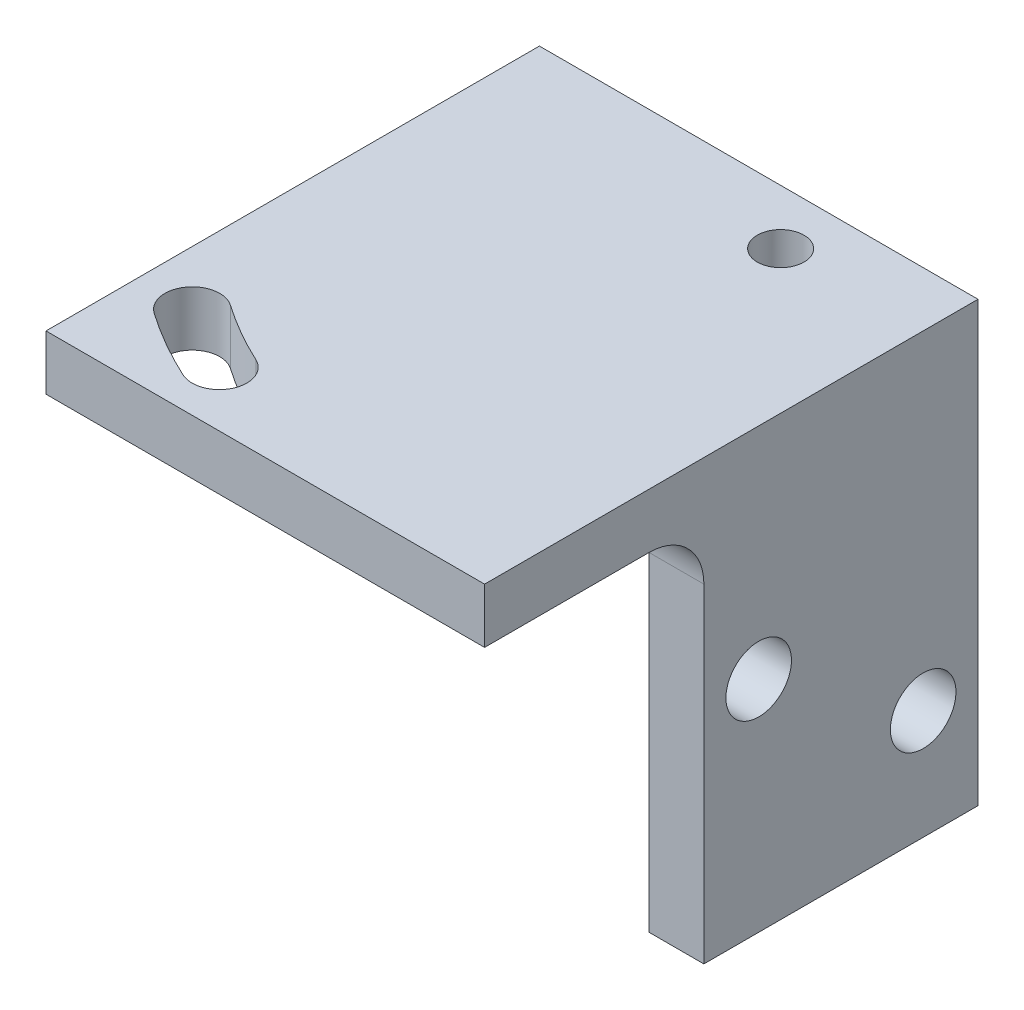
ISO-10303-21;
HEADER;
FILE_DESCRIPTION(('STEP AP214'),'2;1');
FILE_NAME('part.step','',(''),(''),'','','');
FILE_SCHEMA(('AUTOMOTIVE_DESIGN { 1 0 10303 214 1 1 1 1 }'));
ENDSEC;
DATA;
#1=APPLICATION_CONTEXT('core data for automotive mechanical design processes');
#2=APPLICATION_PROTOCOL_DEFINITION('international standard','automotive_design',2000,#1);
#3=PRODUCT_CONTEXT('',#1,'mechanical');
#4=PRODUCT('Part','Part','',(#3));
#5=PRODUCT_RELATED_PRODUCT_CATEGORY('part','',(#4));
#6=PRODUCT_DEFINITION_FORMATION('','',#4);
#7=PRODUCT_DEFINITION_CONTEXT('part definition',#1,'design');
#8=PRODUCT_DEFINITION('design','',#6,#7);
#9=PRODUCT_DEFINITION_SHAPE('','',#8);
#10=(LENGTH_UNIT() NAMED_UNIT(*) SI_UNIT(.MILLI.,.METRE.));
#11=(NAMED_UNIT(*) PLANE_ANGLE_UNIT() SI_UNIT($,.RADIAN.));
#12=(NAMED_UNIT(*) SI_UNIT($,.STERADIAN.) SOLID_ANGLE_UNIT());
#13=UNCERTAINTY_MEASURE_WITH_UNIT(LENGTH_MEASURE(1.E-05),#10,'distance_accuracy_value','');
#14=(GEOMETRIC_REPRESENTATION_CONTEXT(3) GLOBAL_UNCERTAINTY_ASSIGNED_CONTEXT((#13)) GLOBAL_UNIT_ASSIGNED_CONTEXT((#10,
#11,#12)) REPRESENTATION_CONTEXT('',''));
#15=CARTESIAN_POINT('',(0.,0.,0.));
#16=DIRECTION('',(0.,0.,1.));
#17=DIRECTION('',(1.,0.,0.));
#18=AXIS2_PLACEMENT_3D('',#15,#16,#17);
#19=CARTESIAN_POINT('',(-3.175,0.,28.575));
#20=DIRECTION('',(-1.,0.,0.));
#21=DIRECTION('',(0.,-1.,0.));
#22=AXIS2_PLACEMENT_3D('',#19,#20,#21);
#23=PLANE('',#22);
#24=DIRECTION('',(0.,-1.,0.));
#25=VECTOR('',#24,1.);
#26=CARTESIAN_POINT('',(-3.175,-25.4,15.875));
#27=LINE('',#26,#25);
#28=CARTESIAN_POINT('',(-3.175,-6.35,15.875));
#29=VERTEX_POINT('',#28);
#30=CARTESIAN_POINT('',(-3.175,-25.4,15.875));
#31=VERTEX_POINT('',#30);
#32=EDGE_CURVE('E143',#29,#31,#27,.T.);
#33=ORIENTED_EDGE('',*,*,#32,.F.);
#34=DIRECTION('',(0.,0.,-1.));
#35=VECTOR('',#34,1.);
#36=CARTESIAN_POINT('',(-3.175,-6.35,28.575));
#37=LINE('',#36,#35);
#38=CARTESIAN_POINT('',(-3.175,-6.35,0.));
#39=VERTEX_POINT('',#38);
#40=EDGE_CURVE('E176',#29,#39,#37,.T.);
#41=ORIENTED_EDGE('',*,*,#40,.T.);
#42=DIRECTION('',(0.,1.,0.));
#43=VECTOR('',#42,1.);
#44=CARTESIAN_POINT('',(-3.175,0.,0.));
#45=LINE('',#44,#43);
#46=CARTESIAN_POINT('',(-3.175,-25.4,0.));
#47=VERTEX_POINT('',#46);
#48=EDGE_CURVE('E164',#47,#39,#45,.T.);
#49=ORIENTED_EDGE('',*,*,#48,.F.);
#50=DIRECTION('',(0.,0.,-1.));
#51=VECTOR('',#50,1.);
#52=CARTESIAN_POINT('',(-3.175,-25.4,28.575));
#53=LINE('',#52,#51);
#54=EDGE_CURVE('E152',#31,#47,#53,.T.);
#55=ORIENTED_EDGE('',*,*,#54,.F.);
#56=EDGE_LOOP('',(#33,#41,#49,#55));
#57=FACE_BOUND('',#56,.T.);
#58=CARTESIAN_POINT('',(-3.175,-12.7,12.7));
#59=DIRECTION('',(-1.,0.,0.));
#60=DIRECTION('',(0.,0.,1.));
#61=AXIS2_PLACEMENT_3D('',#58,#59,#60);
#62=CIRCLE('',#61,1.89864999999999);
#63=CARTESIAN_POINT('',(-3.175,-12.7,14.59865));
#64=VERTEX_POINT('',#63);
#65=EDGE_CURVE('E221',#64,#64,#62,.T.);
#66=ORIENTED_EDGE('',*,*,#65,.F.);
#67=EDGE_LOOP('',(#66));
#68=FACE_BOUND('',#67,.T.);
#69=CARTESIAN_POINT('',(-3.175,-19.05,3.175));
#70=DIRECTION('',(-1.,0.,0.));
#71=DIRECTION('',(0.,0.,1.));
#72=AXIS2_PLACEMENT_3D('',#69,#70,#71);
#73=CIRCLE('',#72,1.89864999999999);
#74=CARTESIAN_POINT('',(-3.175,-19.05,5.07364999999999));
#75=VERTEX_POINT('',#74);
#76=EDGE_CURVE('E233',#75,#75,#73,.T.);
#77=ORIENTED_EDGE('',*,*,#76,.F.);
#78=EDGE_LOOP('',(#77));
#79=FACE_BOUND('',#78,.T.);
#80=ADVANCED_FACE('F37',(#57,#68,#79),#23,.T.);
#81=CARTESIAN_POINT('',(0.,-25.4,28.575));
#82=DIRECTION('',(0.,-1.,0.));
#83=DIRECTION('',(1.,0.,0.));
#84=AXIS2_PLACEMENT_3D('',#81,#82,#83);
#85=PLANE('',#84);
#86=DIRECTION('',(-1.,0.,0.));
#87=VECTOR('',#86,1.);
#88=CARTESIAN_POINT('',(0.,-25.4,15.875));
#89=LINE('',#88,#87);
#90=CARTESIAN_POINT('',(0.,-25.4,15.875));
#91=VERTEX_POINT('',#90);
#92=EDGE_CURVE('E137',#91,#31,#89,.T.);
#93=ORIENTED_EDGE('',*,*,#92,.T.);
#94=ORIENTED_EDGE('',*,*,#54,.T.);
#95=DIRECTION('',(-1.,0.,0.));
#96=VECTOR('',#95,1.);
#97=CARTESIAN_POINT('',(0.,-25.4,0.));
#98=LINE('',#97,#96);
#99=CARTESIAN_POINT('',(0.,-25.4,0.));
#100=VERTEX_POINT('',#99);
#101=EDGE_CURVE('E150',#100,#47,#98,.T.);
#102=ORIENTED_EDGE('',*,*,#101,.F.);
#103=DIRECTION('',(0.,0.,-1.));
#104=VECTOR('',#103,1.);
#105=CARTESIAN_POINT('',(0.,-25.4,28.575));
#106=LINE('',#105,#104);
#107=EDGE_CURVE('E133',#91,#100,#106,.T.);
#108=ORIENTED_EDGE('',*,*,#107,.F.);
#109=EDGE_LOOP('',(#93,#94,#102,#108));
#110=FACE_BOUND('',#109,.T.);
#111=ADVANCED_FACE('F148',(#110),#85,.T.);
#112=CARTESIAN_POINT('',(0.,0.,28.575));
#113=DIRECTION('',(1.,0.,0.));
#114=DIRECTION('',(0.,1.,0.));
#115=AXIS2_PLACEMENT_3D('',#112,#113,#114);
#116=PLANE('',#115);
#117=DIRECTION('',(0.,0.,-1.));
#118=VECTOR('',#117,1.);
#119=CARTESIAN_POINT('',(0.,-3.175,28.575));
#120=LINE('',#119,#118);
#121=CARTESIAN_POINT('',(0.,-3.175,28.575));
#122=VERTEX_POINT('',#121);
#123=CARTESIAN_POINT('',(0.,-3.175,19.05));
#124=VERTEX_POINT('',#123);
#125=EDGE_CURVE('E138',#122,#124,#120,.T.);
#126=ORIENTED_EDGE('',*,*,#125,.T.);
#127=CARTESIAN_POINT('',(0.,-6.35,19.05));
#128=DIRECTION('',(1.,0.,0.));
#129=DIRECTION('',(0.,1.,0.));
#130=AXIS2_PLACEMENT_3D('',#127,#128,#129);
#131=CIRCLE('',#130,3.175);
#132=CARTESIAN_POINT('',(0.,-6.35,15.875));
#133=VERTEX_POINT('',#132);
#134=EDGE_CURVE('E11',#124,#133,#131,.F.);
#135=ORIENTED_EDGE('',*,*,#134,.T.);
#136=DIRECTION('',(0.,-1.,0.));
#137=VECTOR('',#136,1.);
#138=CARTESIAN_POINT('',(0.,-25.4,15.875));
#139=LINE('',#138,#137);
#140=EDGE_CURVE('E127',#133,#91,#139,.T.);
#141=ORIENTED_EDGE('',*,*,#140,.T.);
#142=ORIENTED_EDGE('',*,*,#107,.T.);
#143=DIRECTION('',(0.,-1.,0.));
#144=VECTOR('',#143,1.);
#145=CARTESIAN_POINT('',(0.,0.,0.));
#146=LINE('',#145,#144);
#147=CARTESIAN_POINT('',(0.,0.,0.));
#148=VERTEX_POINT('',#147);
#149=EDGE_CURVE('E251',#148,#100,#146,.T.);
#150=ORIENTED_EDGE('',*,*,#149,.F.);
#151=DIRECTION('',(0.,0.,-1.));
#152=VECTOR('',#151,1.);
#153=CARTESIAN_POINT('',(0.,0.,28.575));
#154=LINE('',#153,#152);
#155=CARTESIAN_POINT('',(0.,0.,28.575));
#156=VERTEX_POINT('',#155);
#157=EDGE_CURVE('E153',#156,#148,#154,.T.);
#158=ORIENTED_EDGE('',*,*,#157,.F.);
#159=DIRECTION('',(0.,-1.,0.));
#160=VECTOR('',#159,1.);
#161=CARTESIAN_POINT('',(0.,0.,28.575));
#162=LINE('',#161,#160);
#163=EDGE_CURVE('E198',#156,#122,#162,.T.);
#164=ORIENTED_EDGE('',*,*,#163,.T.);
#165=EDGE_LOOP('',(#126,#135,#141,#142,#150,#158,#164));
#166=FACE_BOUND('',#165,.T.);
#167=CARTESIAN_POINT('',(0.,-12.7,12.7));
#168=DIRECTION('',(-1.,0.,0.));
#169=DIRECTION('',(0.,0.,1.));
#170=AXIS2_PLACEMENT_3D('',#167,#168,#169);
#171=CIRCLE('',#170,1.89865);
#172=CARTESIAN_POINT('',(0.,-12.7,14.59865));
#173=VERTEX_POINT('',#172);
#174=EDGE_CURVE('E230',#173,#173,#171,.T.);
#175=ORIENTED_EDGE('',*,*,#174,.T.);
#176=EDGE_LOOP('',(#175));
#177=FACE_BOUND('',#176,.T.);
#178=CARTESIAN_POINT('',(0.,-19.05,3.175));
#179=DIRECTION('',(-1.,0.,0.));
#180=DIRECTION('',(0.,0.,1.));
#181=AXIS2_PLACEMENT_3D('',#178,#179,#180);
#182=CIRCLE('',#181,1.89865);
#183=CARTESIAN_POINT('',(0.,-19.05,5.07365));
#184=VERTEX_POINT('',#183);
#185=EDGE_CURVE('E236',#184,#184,#182,.T.);
#186=ORIENTED_EDGE('',*,*,#185,.T.);
#187=EDGE_LOOP('',(#186));
#188=FACE_BOUND('',#187,.T.);
#189=ADVANCED_FACE('F129',(#166,#177,#188),#116,.T.);
#190=CARTESIAN_POINT('',(0.,0.,28.575));
#191=DIRECTION('',(0.,-1.,0.));
#192=DIRECTION('',(1.,0.,0.));
#193=AXIS2_PLACEMENT_3D('',#190,#191,#192);
#194=PLANE('',#193);
#195=CARTESIAN_POINT('',(-8.255,0.,3.175));
#196=DIRECTION('',(0.,1.,0.));
#197=DIRECTION('',(-1.,0.,0.));
#198=AXIS2_PLACEMENT_3D('',#195,#196,#197);
#199=CIRCLE('',#198,22.8855463980274);
#200=CARTESIAN_POINT('',(-21.3454641445883,0.,21.9469999577965));
#201=VERTEX_POINT('',#200);
#202=CARTESIAN_POINT('',(-17.8868669962838,0.,23.9349463415049));
#203=VERTEX_POINT('',#202);
#204=EDGE_CURVE('E209',#201,#203,#199,.T.);
#205=ORIENTED_EDGE('',*,*,#204,.T.);
#206=CARTESIAN_POINT('',(-18.555,0.,25.375));
#207=DIRECTION('',(0.,1.,0.));
#208=DIRECTION('',(-1.,0.,0.));
#209=AXIS2_PLACEMENT_3D('',#206,#207,#208);
#210=CIRCLE('',#209,1.5875);
#211=CARTESIAN_POINT('',(-19.2231330037162,0.,26.8150536584951));
#212=VERTEX_POINT('',#211);
#213=EDGE_CURVE('E146',#212,#203,#210,.T.);
#214=ORIENTED_EDGE('',*,*,#213,.F.);
#215=CARTESIAN_POINT('',(-8.255,0.,3.175));
#216=DIRECTION('',(0.,1.,0.));
#217=DIRECTION('',(-1.,0.,0.));
#218=AXIS2_PLACEMENT_3D('',#215,#216,#217);
#219=CIRCLE('',#218,26.0605463980274);
#220=CARTESIAN_POINT('',(-23.1615546558749,0.,24.5513118160068));
#221=VERTEX_POINT('',#220);
#222=EDGE_CURVE('E215',#221,#212,#219,.T.);
#223=ORIENTED_EDGE('',*,*,#222,.F.);
#224=CARTESIAN_POINT('',(-22.2535094002316,0.,23.2491558869016));
#225=DIRECTION('',(0.,1.,0.));
#226=DIRECTION('',(-1.,0.,0.));
#227=AXIS2_PLACEMENT_3D('',#224,#225,#226);
#228=CIRCLE('',#227,1.5875);
#229=EDGE_CURVE('E212',#201,#221,#228,.T.);
#230=ORIENTED_EDGE('',*,*,#229,.F.);
#231=EDGE_LOOP('',(#205,#214,#223,#230));
#232=FACE_BOUND('',#231,.T.);
#233=CARTESIAN_POINT('',(-8.255,0.,3.175));
#234=DIRECTION('',(0.,1.,0.));
#235=DIRECTION('',(0.,0.,1.));
#236=AXIS2_PLACEMENT_3D('',#233,#234,#235);
#237=CIRCLE('',#236,1.35254999999999);
#238=CARTESIAN_POINT('',(-8.255,0.,4.52754999999999));
#239=VERTEX_POINT('',#238);
#240=EDGE_CURVE('E165',#239,#239,#237,.T.);
#241=ORIENTED_EDGE('',*,*,#240,.F.);
#242=EDGE_LOOP('',(#241));
#243=FACE_BOUND('',#242,.T.);
#244=DIRECTION('',(-1.,0.,0.));
#245=VECTOR('',#244,1.);
#246=CARTESIAN_POINT('',(0.,0.,0.));
#247=LINE('',#246,#245);
#248=CARTESIAN_POINT('',(-25.4,0.,0.));
#249=VERTEX_POINT('',#248);
#250=EDGE_CURVE('E253',#148,#249,#247,.T.);
#251=ORIENTED_EDGE('',*,*,#250,.T.);
#252=DIRECTION('',(0.,0.,-1.));
#253=VECTOR('',#252,1.);
#254=CARTESIAN_POINT('',(-25.4,0.,28.575));
#255=LINE('',#254,#253);
#256=CARTESIAN_POINT('',(-25.4,0.,28.575));
#257=VERTEX_POINT('',#256);
#258=EDGE_CURVE('E157',#257,#249,#255,.T.);
#259=ORIENTED_EDGE('',*,*,#258,.F.);
#260=DIRECTION('',(-1.,0.,0.));
#261=VECTOR('',#260,1.);
#262=CARTESIAN_POINT('',(0.,0.,28.575));
#263=LINE('',#262,#261);
#264=EDGE_CURVE('E243',#156,#257,#263,.T.);
#265=ORIENTED_EDGE('',*,*,#264,.F.);
#266=ORIENTED_EDGE('',*,*,#157,.T.);
#267=EDGE_LOOP('',(#251,#259,#265,#266));
#268=FACE_BOUND('',#267,.T.);
#269=ADVANCED_FACE('F265',(#232,#243,#268),#194,.F.);
#270=CARTESIAN_POINT('',(-25.4,0.,28.575));
#271=DIRECTION('',(1.,0.,0.));
#272=DIRECTION('',(0.,1.,0.));
#273=AXIS2_PLACEMENT_3D('',#270,#271,#272);
#274=PLANE('',#273);
#275=DIRECTION('',(0.,-1.,0.));
#276=VECTOR('',#275,1.);
#277=CARTESIAN_POINT('',(-25.4,0.,0.));
#278=LINE('',#277,#276);
#279=CARTESIAN_POINT('',(-25.4,-3.175,0.));
#280=VERTEX_POINT('',#279);
#281=EDGE_CURVE('E199',#249,#280,#278,.T.);
#282=ORIENTED_EDGE('',*,*,#281,.T.);
#283=DIRECTION('',(0.,0.,-1.));
#284=VECTOR('',#283,1.);
#285=CARTESIAN_POINT('',(-25.4,-3.175,28.575));
#286=LINE('',#285,#284);
#287=CARTESIAN_POINT('',(-25.4,-3.175,28.575));
#288=VERTEX_POINT('',#287);
#289=EDGE_CURVE('E197',#288,#280,#286,.T.);
#290=ORIENTED_EDGE('',*,*,#289,.F.);
#291=DIRECTION('',(0.,-1.,0.));
#292=VECTOR('',#291,1.);
#293=CARTESIAN_POINT('',(-25.4,0.,28.575));
#294=LINE('',#293,#292);
#295=EDGE_CURVE('E245',#257,#288,#294,.T.);
#296=ORIENTED_EDGE('',*,*,#295,.F.);
#297=ORIENTED_EDGE('',*,*,#258,.T.);
#298=EDGE_LOOP('',(#282,#290,#296,#297));
#299=FACE_BOUND('',#298,.T.);
#300=ADVANCED_FACE('F260',(#299),#274,.F.);
#301=CARTESIAN_POINT('',(0.,-3.175,28.575));
#302=DIRECTION('',(0.,1.,0.));
#303=DIRECTION('',(-1.,0.,0.));
#304=AXIS2_PLACEMENT_3D('',#301,#302,#303);
#305=PLANE('',#304);
#306=CARTESIAN_POINT('',(-8.255,-3.175,3.175));
#307=DIRECTION('',(0.,1.,0.));
#308=DIRECTION('',(-1.,0.,0.));
#309=AXIS2_PLACEMENT_3D('',#306,#307,#308);
#310=CIRCLE('',#309,26.0605463980274);
#311=CARTESIAN_POINT('',(-23.1615546558749,-3.175,24.5513118160068));
#312=VERTEX_POINT('',#311);
#313=CARTESIAN_POINT('',(-19.2231330037162,-3.175,26.8150536584951));
#314=VERTEX_POINT('',#313);
#315=EDGE_CURVE('E170',#312,#314,#310,.T.);
#316=ORIENTED_EDGE('',*,*,#315,.T.);
#317=CARTESIAN_POINT('',(-18.555,-3.175,25.375));
#318=DIRECTION('',(0.,1.,0.));
#319=DIRECTION('',(-1.,0.,0.));
#320=AXIS2_PLACEMENT_3D('',#317,#318,#319);
#321=CIRCLE('',#320,1.5875);
#322=CARTESIAN_POINT('',(-17.8868669962838,-3.175,23.9349463415049));
#323=VERTEX_POINT('',#322);
#324=EDGE_CURVE('E173',#314,#323,#321,.T.);
#325=ORIENTED_EDGE('',*,*,#324,.T.);
#326=CARTESIAN_POINT('',(-8.255,-3.175,3.175));
#327=DIRECTION('',(0.,1.,0.));
#328=DIRECTION('',(-1.,0.,0.));
#329=AXIS2_PLACEMENT_3D('',#326,#327,#328);
#330=CIRCLE('',#329,22.8855463980274);
#331=CARTESIAN_POINT('',(-21.3454641445883,-3.175,21.9469999577965));
#332=VERTEX_POINT('',#331);
#333=EDGE_CURVE('E155',#332,#323,#330,.T.);
#334=ORIENTED_EDGE('',*,*,#333,.F.);
#335=CARTESIAN_POINT('',(-22.2535094002316,-3.175,23.2491558869016));
#336=DIRECTION('',(0.,1.,0.));
#337=DIRECTION('',(-1.,0.,0.));
#338=AXIS2_PLACEMENT_3D('',#335,#336,#337);
#339=CIRCLE('',#338,1.5875);
#340=EDGE_CURVE('E167',#332,#312,#339,.T.);
#341=ORIENTED_EDGE('',*,*,#340,.T.);
#342=EDGE_LOOP('',(#316,#325,#334,#341));
#343=FACE_BOUND('',#342,.T.);
#344=CARTESIAN_POINT('',(-8.255,-3.175,3.175));
#345=DIRECTION('',(0.,1.,0.));
#346=DIRECTION('',(-1.,0.,0.));
#347=AXIS2_PLACEMENT_3D('',#344,#345,#346);
#348=CIRCLE('',#347,1.35254999999999);
#349=CARTESIAN_POINT('',(-9.60754999999999,-3.175,3.175));
#350=VERTEX_POINT('',#349);
#351=EDGE_CURVE('E161',#350,#350,#348,.T.);
#352=ORIENTED_EDGE('',*,*,#351,.T.);
#353=EDGE_LOOP('',(#352));
#354=FACE_BOUND('',#353,.T.);
#355=DIRECTION('',(1.,0.,0.));
#356=VECTOR('',#355,1.);
#357=CARTESIAN_POINT('',(0.,-3.175,0.));
#358=LINE('',#357,#356);
#359=CARTESIAN_POINT('',(-6.35,-3.175,0.));
#360=VERTEX_POINT('',#359);
#361=EDGE_CURVE('E189',#280,#360,#358,.T.);
#362=ORIENTED_EDGE('',*,*,#361,.T.);
#363=DIRECTION('',(0.,0.,-1.));
#364=VECTOR('',#363,1.);
#365=CARTESIAN_POINT('',(-6.35,-3.175,28.575));
#366=LINE('',#365,#364);
#367=CARTESIAN_POINT('',(-6.35,-3.175,19.05));
#368=VERTEX_POINT('',#367);
#369=EDGE_CURVE('E59',#360,#368,#366,.F.);
#370=ORIENTED_EDGE('',*,*,#369,.T.);
#371=DIRECTION('',(-1.,0.,0.));
#372=VECTOR('',#371,1.);
#373=CARTESIAN_POINT('',(0.,-3.175,19.05));
#374=LINE('',#373,#372);
#375=EDGE_CURVE('E179',#368,#124,#374,.F.);
#376=ORIENTED_EDGE('',*,*,#375,.T.);
#377=ORIENTED_EDGE('',*,*,#125,.F.);
#378=DIRECTION('',(1.,0.,0.));
#379=VECTOR('',#378,1.);
#380=CARTESIAN_POINT('',(0.,-3.175,28.575));
#381=LINE('',#380,#379);
#382=EDGE_CURVE('E247',#288,#122,#381,.T.);
#383=ORIENTED_EDGE('',*,*,#382,.F.);
#384=ORIENTED_EDGE('',*,*,#289,.T.);
#385=EDGE_LOOP('',(#362,#370,#376,#377,#383,#384));
#386=FACE_BOUND('',#385,.T.);
#387=ADVANCED_FACE('F194',(#343,#354,#386),#305,.F.);
#388=CARTESIAN_POINT('',(0.,0.,28.575));
#389=DIRECTION('',(0.,0.,1.));
#390=DIRECTION('',(1.,0.,0.));
#391=AXIS2_PLACEMENT_3D('',#388,#389,#390);
#392=PLANE('',#391);
#393=ORIENTED_EDGE('',*,*,#382,.T.);
#394=ORIENTED_EDGE('',*,*,#163,.F.);
#395=ORIENTED_EDGE('',*,*,#264,.T.);
#396=ORIENTED_EDGE('',*,*,#295,.T.);
#397=EDGE_LOOP('',(#393,#394,#395,#396));
#398=FACE_BOUND('',#397,.T.);
#399=ADVANCED_FACE('F267',(#398),#392,.T.);
#400=CARTESIAN_POINT('',(0.,0.,0.));
#401=DIRECTION('',(0.,0.,1.));
#402=DIRECTION('',(1.,0.,0.));
#403=AXIS2_PLACEMENT_3D('',#400,#401,#402);
#404=PLANE('',#403);
#405=ORIENTED_EDGE('',*,*,#48,.T.);
#406=CARTESIAN_POINT('',(-6.35,-6.35,0.));
#407=DIRECTION('',(0.,0.,1.));
#408=DIRECTION('',(1.,0.,0.));
#409=AXIS2_PLACEMENT_3D('',#406,#407,#408);
#410=CIRCLE('',#409,3.175);
#411=EDGE_CURVE('E46',#39,#360,#410,.T.);
#412=ORIENTED_EDGE('',*,*,#411,.T.);
#413=ORIENTED_EDGE('',*,*,#361,.F.);
#414=ORIENTED_EDGE('',*,*,#281,.F.);
#415=ORIENTED_EDGE('',*,*,#250,.F.);
#416=ORIENTED_EDGE('',*,*,#149,.T.);
#417=ORIENTED_EDGE('',*,*,#101,.T.);
#418=EDGE_LOOP('',(#405,#412,#413,#414,#415,#416,#417));
#419=FACE_BOUND('',#418,.T.);
#420=ADVANCED_FACE('F187',(#419),#404,.F.);
#421=CARTESIAN_POINT('',(-8.255,0.,3.175));
#422=DIRECTION('',(0.,1.,0.));
#423=DIRECTION('',(0.,0.,1.));
#424=AXIS2_PLACEMENT_3D('',#421,#422,#423);
#425=CYLINDRICAL_SURFACE('',#424,1.35254999999999);
#426=ORIENTED_EDGE('',*,*,#240,.T.);
#427=EDGE_LOOP('',(#426));
#428=FACE_BOUND('',#427,.T.);
#429=ORIENTED_EDGE('',*,*,#351,.F.);
#430=EDGE_LOOP('',(#429));
#431=FACE_BOUND('',#430,.T.);
#432=ADVANCED_FACE('F280',(#428,#431),#425,.F.);
#433=CARTESIAN_POINT('',(-3.175,-19.05,3.175));
#434=DIRECTION('',(-1.,0.,0.));
#435=DIRECTION('',(0.,0.,1.));
#436=AXIS2_PLACEMENT_3D('',#433,#434,#435);
#437=CYLINDRICAL_SURFACE('',#436,1.89864999999999);
#438=ORIENTED_EDGE('',*,*,#185,.F.);
#439=EDGE_LOOP('',(#438));
#440=FACE_BOUND('',#439,.T.);
#441=ORIENTED_EDGE('',*,*,#76,.T.);
#442=EDGE_LOOP('',(#441));
#443=FACE_BOUND('',#442,.T.);
#444=ADVANCED_FACE('F277',(#440,#443),#437,.F.);
#445=CARTESIAN_POINT('',(-3.175,-12.7,12.7));
#446=DIRECTION('',(-1.,0.,0.));
#447=DIRECTION('',(0.,0.,1.));
#448=AXIS2_PLACEMENT_3D('',#445,#446,#447);
#449=CYLINDRICAL_SURFACE('',#448,1.89864999999999);
#450=ORIENTED_EDGE('',*,*,#174,.F.);
#451=EDGE_LOOP('',(#450));
#452=FACE_BOUND('',#451,.T.);
#453=ORIENTED_EDGE('',*,*,#65,.T.);
#454=EDGE_LOOP('',(#453));
#455=FACE_BOUND('',#454,.T.);
#456=ADVANCED_FACE('F279',(#452,#455),#449,.F.);
#457=CARTESIAN_POINT('',(-18.555,-25.4,25.375));
#458=DIRECTION('',(0.,1.,0.));
#459=DIRECTION('',(-1.,0.,0.));
#460=AXIS2_PLACEMENT_3D('',#457,#458,#459);
#461=CYLINDRICAL_SURFACE('',#460,1.5875);
#462=DIRECTION('',(0.,1.,0.));
#463=VECTOR('',#462,1.);
#464=CARTESIAN_POINT('',(-19.2231330037162,-25.4,26.8150536584951));
#465=LINE('',#464,#463);
#466=EDGE_CURVE('E219',#314,#212,#465,.T.);
#467=ORIENTED_EDGE('',*,*,#466,.T.);
#468=ORIENTED_EDGE('',*,*,#213,.T.);
#469=DIRECTION('',(0.,1.,0.));
#470=VECTOR('',#469,1.);
#471=CARTESIAN_POINT('',(-17.8868669962838,-25.4,23.9349463415049));
#472=LINE('',#471,#470);
#473=EDGE_CURVE('E218',#323,#203,#472,.T.);
#474=ORIENTED_EDGE('',*,*,#473,.F.);
#475=ORIENTED_EDGE('',*,*,#324,.F.);
#476=EDGE_LOOP('',(#467,#468,#474,#475));
#477=FACE_BOUND('',#476,.T.);
#478=ADVANCED_FACE('F287',(#477),#461,.F.);
#479=CARTESIAN_POINT('',(-8.255,-25.4,3.175));
#480=DIRECTION('',(0.,1.,0.));
#481=DIRECTION('',(-1.,0.,0.));
#482=AXIS2_PLACEMENT_3D('',#479,#480,#481);
#483=CYLINDRICAL_SURFACE('',#482,26.0605463980274);
#484=DIRECTION('',(0.,1.,0.));
#485=VECTOR('',#484,1.);
#486=CARTESIAN_POINT('',(-23.1615546558749,-25.4,24.5513118160068));
#487=LINE('',#486,#485);
#488=EDGE_CURVE('E222',#312,#221,#487,.T.);
#489=ORIENTED_EDGE('',*,*,#488,.T.);
#490=ORIENTED_EDGE('',*,*,#222,.T.);
#491=ORIENTED_EDGE('',*,*,#466,.F.);
#492=ORIENTED_EDGE('',*,*,#315,.F.);
#493=EDGE_LOOP('',(#489,#490,#491,#492));
#494=FACE_BOUND('',#493,.T.);
#495=ADVANCED_FACE('F326',(#494),#483,.F.);
#496=CARTESIAN_POINT('',(-22.2535094002316,-25.4,23.2491558869016));
#497=DIRECTION('',(0.,1.,0.));
#498=DIRECTION('',(-1.,0.,0.));
#499=AXIS2_PLACEMENT_3D('',#496,#497,#498);
#500=CYLINDRICAL_SURFACE('',#499,1.5875);
#501=DIRECTION('',(0.,1.,0.));
#502=VECTOR('',#501,1.);
#503=CARTESIAN_POINT('',(-21.3454641445883,-25.4,21.9469999577965));
#504=LINE('',#503,#502);
#505=EDGE_CURVE('E224',#332,#201,#504,.T.);
#506=ORIENTED_EDGE('',*,*,#505,.T.);
#507=ORIENTED_EDGE('',*,*,#229,.T.);
#508=ORIENTED_EDGE('',*,*,#488,.F.);
#509=ORIENTED_EDGE('',*,*,#340,.F.);
#510=EDGE_LOOP('',(#506,#507,#508,#509));
#511=FACE_BOUND('',#510,.T.);
#512=ADVANCED_FACE('F322',(#511),#500,.F.);
#513=CARTESIAN_POINT('',(-8.255,-25.4,3.175));
#514=DIRECTION('',(0.,1.,0.));
#515=DIRECTION('',(-1.,0.,0.));
#516=AXIS2_PLACEMENT_3D('',#513,#514,#515);
#517=CYLINDRICAL_SURFACE('',#516,22.8855463980274);
#518=ORIENTED_EDGE('',*,*,#333,.T.);
#519=ORIENTED_EDGE('',*,*,#473,.T.);
#520=ORIENTED_EDGE('',*,*,#204,.F.);
#521=ORIENTED_EDGE('',*,*,#505,.F.);
#522=EDGE_LOOP('',(#518,#519,#520,#521));
#523=FACE_BOUND('',#522,.T.);
#524=ADVANCED_FACE('F317',(#523),#517,.T.);
#525=CARTESIAN_POINT('',(0.,-25.4,15.875));
#526=DIRECTION('',(0.,0.,-1.));
#527=DIRECTION('',(-1.,0.,0.));
#528=AXIS2_PLACEMENT_3D('',#525,#526,#527);
#529=PLANE('',#528);
#530=ORIENTED_EDGE('',*,*,#140,.F.);
#531=DIRECTION('',(-1.,0.,0.));
#532=VECTOR('',#531,1.);
#533=CARTESIAN_POINT('',(-3.175,-6.35,15.875));
#534=LINE('',#533,#532);
#535=EDGE_CURVE('E182',#133,#29,#534,.T.);
#536=ORIENTED_EDGE('',*,*,#535,.T.);
#537=ORIENTED_EDGE('',*,*,#32,.T.);
#538=ORIENTED_EDGE('',*,*,#92,.F.);
#539=EDGE_LOOP('',(#530,#536,#537,#538));
#540=FACE_BOUND('',#539,.T.);
#541=ADVANCED_FACE('F141',(#540),#529,.F.);
#542=CARTESIAN_POINT('',(0.,-6.35,19.05));
#543=DIRECTION('',(1.,0.,0.));
#544=DIRECTION('',(0.,1.,0.));
#545=AXIS2_PLACEMENT_3D('',#542,#543,#544);
#546=CYLINDRICAL_SURFACE('',#545,3.175);
#547=ORIENTED_EDGE('',*,*,#134,.F.);
#548=ORIENTED_EDGE('',*,*,#375,.F.);
#549=CARTESIAN_POINT('',(-6.35,-6.35,19.05));
#550=DIRECTION('',(0.707106781186547,0.,0.707106781186547));
#551=DIRECTION('',(0.707106781186547,0.,-0.707106781186547));
#552=AXIS2_PLACEMENT_3D('',#549,#550,#551);
#553=ELLIPSE('',#552,4.49012806053458,3.175);
#554=EDGE_CURVE('E41',#29,#368,#553,.T.);
#555=ORIENTED_EDGE('',*,*,#554,.F.);
#556=ORIENTED_EDGE('',*,*,#535,.F.);
#557=EDGE_LOOP('',(#547,#548,#555,#556));
#558=FACE_BOUND('',#557,.T.);
#559=ADVANCED_FACE('F39',(#558),#546,.F.);
#560=CARTESIAN_POINT('',(-6.35,-6.35,28.575));
#561=DIRECTION('',(0.,0.,-1.));
#562=DIRECTION('',(-1.,0.,0.));
#563=AXIS2_PLACEMENT_3D('',#560,#561,#562);
#564=CYLINDRICAL_SURFACE('',#563,3.175);
#565=ORIENTED_EDGE('',*,*,#554,.T.);
#566=ORIENTED_EDGE('',*,*,#369,.F.);
#567=ORIENTED_EDGE('',*,*,#411,.F.);
#568=ORIENTED_EDGE('',*,*,#40,.F.);
#569=EDGE_LOOP('',(#565,#566,#567,#568));
#570=FACE_BOUND('',#569,.T.);
#571=ADVANCED_FACE('F202',(#570),#564,.F.);
#572=CLOSED_SHELL('',(#80,#111,#189,#269,#300,#387,#399,#420,#432,#444,#456,#478,#495,#512,#524,
#541,#559,#571));
#573=MANIFOLD_SOLID_BREP('B2',#572);
#574=ADVANCED_BREP_SHAPE_REPRESENTATION('',(#18,#573),#14);
#575=SHAPE_DEFINITION_REPRESENTATION(#9,#574);
ENDSEC;
END-ISO-10303-21;
